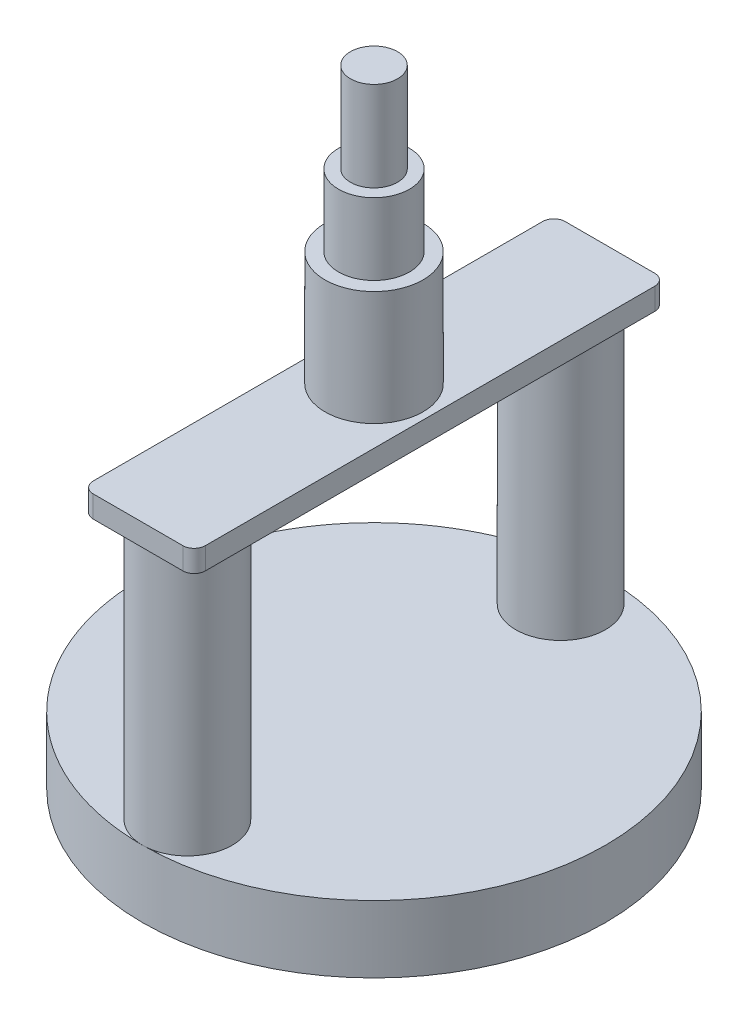
ISO-10303-21;
HEADER;
FILE_DESCRIPTION(('STEP AP214'),'2;1');
FILE_NAME('part.step','',(''),(''),'','','');
FILE_SCHEMA(('AUTOMOTIVE_DESIGN { 1 0 10303 214 1 1 1 1 }'));
ENDSEC;
DATA;
#1=APPLICATION_CONTEXT('core data for automotive mechanical design processes');
#2=APPLICATION_PROTOCOL_DEFINITION('international standard','automotive_design',2000,#1);
#3=PRODUCT_CONTEXT('',#1,'mechanical');
#4=PRODUCT('Part','Part','',(#3));
#5=PRODUCT_RELATED_PRODUCT_CATEGORY('part','',(#4));
#6=PRODUCT_DEFINITION_FORMATION('','',#4);
#7=PRODUCT_DEFINITION_CONTEXT('part definition',#1,'design');
#8=PRODUCT_DEFINITION('design','',#6,#7);
#9=PRODUCT_DEFINITION_SHAPE('','',#8);
#10=(LENGTH_UNIT() NAMED_UNIT(*) SI_UNIT(.MILLI.,.METRE.));
#11=(NAMED_UNIT(*) PLANE_ANGLE_UNIT() SI_UNIT($,.RADIAN.));
#12=(NAMED_UNIT(*) SI_UNIT($,.STERADIAN.) SOLID_ANGLE_UNIT());
#13=UNCERTAINTY_MEASURE_WITH_UNIT(LENGTH_MEASURE(1.E-05),#10,'distance_accuracy_value','');
#14=(GEOMETRIC_REPRESENTATION_CONTEXT(3) GLOBAL_UNCERTAINTY_ASSIGNED_CONTEXT((#13)) GLOBAL_UNIT_ASSIGNED_CONTEXT((#10,
#11,#12)) REPRESENTATION_CONTEXT('',''));
#15=CARTESIAN_POINT('',(0.,0.,0.));
#16=DIRECTION('',(0.,0.,1.));
#17=DIRECTION('',(1.,0.,0.));
#18=AXIS2_PLACEMENT_3D('',#15,#16,#17);
#19=CARTESIAN_POINT('',(0.,5.98,0.));
#20=DIRECTION('',(0.,-1.,0.));
#21=DIRECTION('',(0.,0.,-1.));
#22=AXIS2_PLACEMENT_3D('',#19,#20,#21);
#23=CYLINDRICAL_SURFACE('',#22,20.65);
#24=CARTESIAN_POINT('',(0.,5.98,0.));
#25=DIRECTION('',(0.,1.,0.));
#26=DIRECTION('',(0.,0.,1.));
#27=AXIS2_PLACEMENT_3D('',#24,#25,#26);
#28=CIRCLE('',#27,20.65);
#29=CARTESIAN_POINT('',(0.,5.98,20.65));
#30=VERTEX_POINT('',#29);
#31=CARTESIAN_POINT('',(0.,5.98,-20.65));
#32=VERTEX_POINT('',#31);
#33=EDGE_CURVE('E146',#30,#32,#28,.T.);
#34=ORIENTED_EDGE('',*,*,#33,.F.);
#35=EDGE_CURVE('E53',#32,#30,#28,.T.);
#36=ORIENTED_EDGE('',*,*,#35,.F.);
#37=EDGE_LOOP('',(#34,#36));
#38=FACE_BOUND('',#37,.T.);
#39=CARTESIAN_POINT('',(0.,0.,0.));
#40=DIRECTION('',(0.,1.,0.));
#41=DIRECTION('',(0.,0.,1.));
#42=AXIS2_PLACEMENT_3D('',#39,#40,#41);
#43=CIRCLE('',#42,20.65);
#44=CARTESIAN_POINT('',(0.,0.,20.65));
#45=VERTEX_POINT('',#44);
#46=EDGE_CURVE('E143',#45,#45,#43,.T.);
#47=ORIENTED_EDGE('',*,*,#46,.T.);
#48=EDGE_LOOP('',(#47));
#49=FACE_BOUND('',#48,.T.);
#50=ADVANCED_FACE('F33',(#38,#49),#23,.T.);
#51=CARTESIAN_POINT('',(0.,5.98,0.));
#52=DIRECTION('',(0.,1.,0.));
#53=DIRECTION('',(0.,0.,1.));
#54=AXIS2_PLACEMENT_3D('',#51,#52,#53);
#55=PLANE('',#54);
#56=ORIENTED_EDGE('',*,*,#33,.T.);
#57=CARTESIAN_POINT('',(0.,5.98,-16.65));
#58=DIRECTION('',(0.,1.,0.));
#59=DIRECTION('',(0.,0.,1.));
#60=AXIS2_PLACEMENT_3D('',#57,#58,#59);
#61=CIRCLE('',#60,4.);
#62=EDGE_CURVE('E47',#32,#32,#61,.T.);
#63=ORIENTED_EDGE('',*,*,#62,.F.);
#64=ORIENTED_EDGE('',*,*,#35,.T.);
#65=CARTESIAN_POINT('',(0.,5.98,16.65));
#66=DIRECTION('',(0.,1.,0.));
#67=DIRECTION('',(0.,0.,1.));
#68=AXIS2_PLACEMENT_3D('',#65,#66,#67);
#69=CIRCLE('',#68,4.);
#70=EDGE_CURVE('E138',#30,#30,#69,.T.);
#71=ORIENTED_EDGE('',*,*,#70,.F.);
#72=EDGE_LOOP('',(#56,#63,#64,#71));
#73=FACE_BOUND('',#72,.T.);
#74=ADVANCED_FACE('F155',(#73),#55,.T.);
#75=CARTESIAN_POINT('',(0.,0.,0.));
#76=DIRECTION('',(0.,1.,0.));
#77=DIRECTION('',(0.,0.,1.));
#78=AXIS2_PLACEMENT_3D('',#75,#76,#77);
#79=PLANE('',#78);
#80=ORIENTED_EDGE('',*,*,#46,.F.);
#81=EDGE_LOOP('',(#80));
#82=FACE_BOUND('',#81,.T.);
#83=ADVANCED_FACE('F152',(#82),#79,.F.);
#84=CARTESIAN_POINT('',(0.,29.38,16.65));
#85=DIRECTION('',(0.,-1.,0.));
#86=DIRECTION('',(0.,0.,-1.));
#87=AXIS2_PLACEMENT_3D('',#84,#85,#86);
#88=CYLINDRICAL_SURFACE('',#87,4.);
#89=CARTESIAN_POINT('',(0.,29.38,16.65));
#90=DIRECTION('',(0.,1.,0.));
#91=DIRECTION('',(0.,0.,1.));
#92=AXIS2_PLACEMENT_3D('',#89,#90,#91);
#93=CIRCLE('',#92,4.);
#94=CARTESIAN_POINT('',(0.,29.38,20.65));
#95=VERTEX_POINT('',#94);
#96=EDGE_CURVE('E140',#95,#95,#93,.T.);
#97=ORIENTED_EDGE('',*,*,#96,.F.);
#98=EDGE_LOOP('',(#97));
#99=FACE_BOUND('',#98,.T.);
#100=ORIENTED_EDGE('',*,*,#70,.T.);
#101=EDGE_LOOP('',(#100));
#102=FACE_BOUND('',#101,.T.);
#103=ADVANCED_FACE('F154',(#99,#102),#88,.T.);
#104=CARTESIAN_POINT('',(0.,29.38,-16.65));
#105=DIRECTION('',(0.,-1.,0.));
#106=DIRECTION('',(0.,0.,-1.));
#107=AXIS2_PLACEMENT_3D('',#104,#105,#106);
#108=CYLINDRICAL_SURFACE('',#107,4.);
#109=CARTESIAN_POINT('',(0.,29.38,-16.65));
#110=DIRECTION('',(0.,1.,0.));
#111=DIRECTION('',(0.,0.,1.));
#112=AXIS2_PLACEMENT_3D('',#109,#110,#111);
#113=CIRCLE('',#112,4.);
#114=CARTESIAN_POINT('',(0.,29.38,-12.65));
#115=VERTEX_POINT('',#114);
#116=EDGE_CURVE('E131',#115,#115,#113,.T.);
#117=ORIENTED_EDGE('',*,*,#116,.F.);
#118=EDGE_LOOP('',(#117));
#119=FACE_BOUND('',#118,.T.);
#120=ORIENTED_EDGE('',*,*,#62,.T.);
#121=EDGE_LOOP('',(#120));
#122=FACE_BOUND('',#121,.T.);
#123=ADVANCED_FACE('F160',(#119,#122),#108,.T.);
#124=CARTESIAN_POINT('',(4.,31.33,-20.05));
#125=DIRECTION('',(0.,-1.,0.));
#126=DIRECTION('',(0.,0.,-1.));
#127=AXIS2_PLACEMENT_3D('',#124,#125,#126);
#128=CYLINDRICAL_SURFACE('',#127,1.);
#129=CARTESIAN_POINT('',(4.,29.38,-20.05));
#130=DIRECTION('',(0.,1.,0.));
#131=DIRECTION('',(0.,0.,-1.));
#132=AXIS2_PLACEMENT_3D('',#129,#130,#131);
#133=CIRCLE('',#132,1.);
#134=CARTESIAN_POINT('',(5.,29.38,-20.05));
#135=VERTEX_POINT('',#134);
#136=CARTESIAN_POINT('',(3.99999999999999,29.38,-21.05));
#137=VERTEX_POINT('',#136);
#138=EDGE_CURVE('E129',#135,#137,#133,.T.);
#139=ORIENTED_EDGE('',*,*,#138,.T.);
#140=DIRECTION('',(0.,-1.,0.));
#141=VECTOR('',#140,1.);
#142=CARTESIAN_POINT('',(3.99999999999999,31.33,-21.05));
#143=LINE('',#142,#141);
#144=CARTESIAN_POINT('',(3.99999999999999,31.33,-21.05));
#145=VERTEX_POINT('',#144);
#146=EDGE_CURVE('E109',#145,#137,#143,.T.);
#147=ORIENTED_EDGE('',*,*,#146,.F.);
#148=CARTESIAN_POINT('',(4.,31.33,-20.05));
#149=DIRECTION('',(0.,1.,0.));
#150=DIRECTION('',(0.,0.,-1.));
#151=AXIS2_PLACEMENT_3D('',#148,#149,#150);
#152=CIRCLE('',#151,1.);
#153=CARTESIAN_POINT('',(5.,31.33,-20.05));
#154=VERTEX_POINT('',#153);
#155=EDGE_CURVE('E116',#154,#145,#152,.T.);
#156=ORIENTED_EDGE('',*,*,#155,.F.);
#157=DIRECTION('',(0.,-1.,0.));
#158=VECTOR('',#157,1.);
#159=CARTESIAN_POINT('',(5.,31.33,-20.05));
#160=LINE('',#159,#158);
#161=EDGE_CURVE('E370',#154,#135,#160,.T.);
#162=ORIENTED_EDGE('',*,*,#161,.T.);
#163=EDGE_LOOP('',(#139,#147,#156,#162));
#164=FACE_BOUND('',#163,.T.);
#165=ADVANCED_FACE('F127',(#164),#128,.T.);
#166=CARTESIAN_POINT('',(-3.99999999999999,31.33,-21.05));
#167=DIRECTION('',(0.,0.,1.));
#168=DIRECTION('',(1.,0.,0.));
#169=AXIS2_PLACEMENT_3D('',#166,#167,#168);
#170=PLANE('',#169);
#171=DIRECTION('',(-1.,0.,0.));
#172=VECTOR('',#171,1.);
#173=CARTESIAN_POINT('',(-3.99999999999999,29.38,-21.05));
#174=LINE('',#173,#172);
#175=CARTESIAN_POINT('',(-3.99999999999999,29.38,-21.05));
#176=VERTEX_POINT('',#175);
#177=EDGE_CURVE('E372',#137,#176,#174,.T.);
#178=ORIENTED_EDGE('',*,*,#177,.T.);
#179=DIRECTION('',(0.,-1.,0.));
#180=VECTOR('',#179,1.);
#181=CARTESIAN_POINT('',(-3.99999999999999,31.33,-21.05));
#182=LINE('',#181,#180);
#183=CARTESIAN_POINT('',(-3.99999999999999,31.33,-21.05));
#184=VERTEX_POINT('',#183);
#185=EDGE_CURVE('E112',#184,#176,#182,.T.);
#186=ORIENTED_EDGE('',*,*,#185,.F.);
#187=DIRECTION('',(-1.,0.,0.));
#188=VECTOR('',#187,1.);
#189=CARTESIAN_POINT('',(-3.99999999999999,31.33,-21.05));
#190=LINE('',#189,#188);
#191=EDGE_CURVE('E105',#145,#184,#190,.T.);
#192=ORIENTED_EDGE('',*,*,#191,.F.);
#193=ORIENTED_EDGE('',*,*,#146,.T.);
#194=EDGE_LOOP('',(#178,#186,#192,#193));
#195=FACE_BOUND('',#194,.T.);
#196=ADVANCED_FACE('F107',(#195),#170,.F.);
#197=CARTESIAN_POINT('',(-4.,31.33,-20.05));
#198=DIRECTION('',(0.,-1.,0.));
#199=DIRECTION('',(0.,0.,-1.));
#200=AXIS2_PLACEMENT_3D('',#197,#198,#199);
#201=CYLINDRICAL_SURFACE('',#200,1.);
#202=CARTESIAN_POINT('',(-4.,29.38,-20.05));
#203=DIRECTION('',(0.,1.,0.));
#204=DIRECTION('',(0.,0.,-1.));
#205=AXIS2_PLACEMENT_3D('',#202,#203,#204);
#206=CIRCLE('',#205,1.);
#207=CARTESIAN_POINT('',(-5.,29.38,-20.05));
#208=VERTEX_POINT('',#207);
#209=EDGE_CURVE('E374',#176,#208,#206,.T.);
#210=ORIENTED_EDGE('',*,*,#209,.T.);
#211=DIRECTION('',(0.,-1.,0.));
#212=VECTOR('',#211,1.);
#213=CARTESIAN_POINT('',(-5.,31.33,-20.05));
#214=LINE('',#213,#212);
#215=CARTESIAN_POINT('',(-5.,31.33,-20.05));
#216=VERTEX_POINT('',#215);
#217=EDGE_CURVE('E133',#216,#208,#214,.T.);
#218=ORIENTED_EDGE('',*,*,#217,.F.);
#219=CARTESIAN_POINT('',(-4.,31.33,-20.05));
#220=DIRECTION('',(0.,1.,0.));
#221=DIRECTION('',(0.,0.,-1.));
#222=AXIS2_PLACEMENT_3D('',#219,#220,#221);
#223=CIRCLE('',#222,1.);
#224=EDGE_CURVE('E115',#184,#216,#223,.T.);
#225=ORIENTED_EDGE('',*,*,#224,.F.);
#226=ORIENTED_EDGE('',*,*,#185,.T.);
#227=EDGE_LOOP('',(#210,#218,#225,#226));
#228=FACE_BOUND('',#227,.T.);
#229=ADVANCED_FACE('F205',(#228),#201,.T.);
#230=CARTESIAN_POINT('',(-5.,31.33,20.05));
#231=DIRECTION('',(1.,0.,0.));
#232=DIRECTION('',(0.,0.,-1.));
#233=AXIS2_PLACEMENT_3D('',#230,#231,#232);
#234=PLANE('',#233);
#235=DIRECTION('',(0.,0.,1.));
#236=VECTOR('',#235,1.);
#237=CARTESIAN_POINT('',(-5.,29.38,20.05));
#238=LINE('',#237,#236);
#239=CARTESIAN_POINT('',(-5.,29.38,20.05));
#240=VERTEX_POINT('',#239);
#241=EDGE_CURVE('E376',#208,#240,#238,.T.);
#242=ORIENTED_EDGE('',*,*,#241,.T.);
#243=DIRECTION('',(0.,-1.,0.));
#244=VECTOR('',#243,1.);
#245=CARTESIAN_POINT('',(-5.,31.33,20.05));
#246=LINE('',#245,#244);
#247=CARTESIAN_POINT('',(-5.,31.33,20.05));
#248=VERTEX_POINT('',#247);
#249=EDGE_CURVE('E395',#248,#240,#246,.T.);
#250=ORIENTED_EDGE('',*,*,#249,.F.);
#251=DIRECTION('',(0.,0.,1.));
#252=VECTOR('',#251,1.);
#253=CARTESIAN_POINT('',(-5.,31.33,20.05));
#254=LINE('',#253,#252);
#255=EDGE_CURVE('E361',#216,#248,#254,.T.);
#256=ORIENTED_EDGE('',*,*,#255,.F.);
#257=ORIENTED_EDGE('',*,*,#217,.T.);
#258=EDGE_LOOP('',(#242,#250,#256,#257));
#259=FACE_BOUND('',#258,.T.);
#260=ADVANCED_FACE('F214',(#259),#234,.F.);
#261=CARTESIAN_POINT('',(-4.,31.33,20.05));
#262=DIRECTION('',(0.,-1.,0.));
#263=DIRECTION('',(0.,0.,-1.));
#264=AXIS2_PLACEMENT_3D('',#261,#262,#263);
#265=CYLINDRICAL_SURFACE('',#264,1.);
#266=CARTESIAN_POINT('',(-4.,29.38,20.05));
#267=DIRECTION('',(0.,1.,0.));
#268=DIRECTION('',(0.,0.,-1.));
#269=AXIS2_PLACEMENT_3D('',#266,#267,#268);
#270=CIRCLE('',#269,1.);
#271=CARTESIAN_POINT('',(-3.99999999999999,29.38,21.05));
#272=VERTEX_POINT('',#271);
#273=EDGE_CURVE('E378',#240,#272,#270,.T.);
#274=ORIENTED_EDGE('',*,*,#273,.T.);
#275=DIRECTION('',(0.,-1.,0.));
#276=VECTOR('',#275,1.);
#277=CARTESIAN_POINT('',(-3.99999999999999,31.33,21.05));
#278=LINE('',#277,#276);
#279=CARTESIAN_POINT('',(-3.99999999999999,31.33,21.05));
#280=VERTEX_POINT('',#279);
#281=EDGE_CURVE('E392',#280,#272,#278,.T.);
#282=ORIENTED_EDGE('',*,*,#281,.F.);
#283=CARTESIAN_POINT('',(-4.,31.33,20.05));
#284=DIRECTION('',(0.,1.,0.));
#285=DIRECTION('',(0.,0.,-1.));
#286=AXIS2_PLACEMENT_3D('',#283,#284,#285);
#287=CIRCLE('',#286,1.);
#288=EDGE_CURVE('E363',#248,#280,#287,.T.);
#289=ORIENTED_EDGE('',*,*,#288,.F.);
#290=ORIENTED_EDGE('',*,*,#249,.T.);
#291=EDGE_LOOP('',(#274,#282,#289,#290));
#292=FACE_BOUND('',#291,.T.);
#293=ADVANCED_FACE('F224',(#292),#265,.T.);
#294=CARTESIAN_POINT('',(-3.99999999999999,31.33,21.05));
#295=DIRECTION('',(0.,0.,-1.));
#296=DIRECTION('',(-1.,0.,0.));
#297=AXIS2_PLACEMENT_3D('',#294,#295,#296);
#298=PLANE('',#297);
#299=DIRECTION('',(1.,0.,0.));
#300=VECTOR('',#299,1.);
#301=CARTESIAN_POINT('',(-3.99999999999999,29.38,21.05));
#302=LINE('',#301,#300);
#303=CARTESIAN_POINT('',(3.99999999999999,29.38,21.05));
#304=VERTEX_POINT('',#303);
#305=EDGE_CURVE('E380',#272,#304,#302,.T.);
#306=ORIENTED_EDGE('',*,*,#305,.T.);
#307=DIRECTION('',(0.,-1.,0.));
#308=VECTOR('',#307,1.);
#309=CARTESIAN_POINT('',(3.99999999999999,31.33,21.05));
#310=LINE('',#309,#308);
#311=CARTESIAN_POINT('',(3.99999999999999,31.33,21.05));
#312=VERTEX_POINT('',#311);
#313=EDGE_CURVE('E389',#312,#304,#310,.T.);
#314=ORIENTED_EDGE('',*,*,#313,.F.);
#315=DIRECTION('',(1.,0.,0.));
#316=VECTOR('',#315,1.);
#317=CARTESIAN_POINT('',(-3.99999999999999,31.33,21.05));
#318=LINE('',#317,#316);
#319=EDGE_CURVE('E365',#280,#312,#318,.T.);
#320=ORIENTED_EDGE('',*,*,#319,.F.);
#321=ORIENTED_EDGE('',*,*,#281,.T.);
#322=EDGE_LOOP('',(#306,#314,#320,#321));
#323=FACE_BOUND('',#322,.T.);
#324=ADVANCED_FACE('F234',(#323),#298,.F.);
#325=CARTESIAN_POINT('',(4.,31.33,20.05));
#326=DIRECTION('',(0.,-1.,0.));
#327=DIRECTION('',(0.,0.,-1.));
#328=AXIS2_PLACEMENT_3D('',#325,#326,#327);
#329=CYLINDRICAL_SURFACE('',#328,1.);
#330=CARTESIAN_POINT('',(4.,29.38,20.05));
#331=DIRECTION('',(0.,1.,0.));
#332=DIRECTION('',(0.,0.,1.));
#333=AXIS2_PLACEMENT_3D('',#330,#331,#332);
#334=CIRCLE('',#333,1.);
#335=CARTESIAN_POINT('',(5.,29.38,20.05));
#336=VERTEX_POINT('',#335);
#337=EDGE_CURVE('E382',#304,#336,#334,.T.);
#338=ORIENTED_EDGE('',*,*,#337,.T.);
#339=DIRECTION('',(0.,-1.,0.));
#340=VECTOR('',#339,1.);
#341=CARTESIAN_POINT('',(5.,31.33,20.05));
#342=LINE('',#341,#340);
#343=CARTESIAN_POINT('',(5.,31.33,20.05));
#344=VERTEX_POINT('',#343);
#345=EDGE_CURVE('E386',#344,#336,#342,.T.);
#346=ORIENTED_EDGE('',*,*,#345,.F.);
#347=CARTESIAN_POINT('',(4.,31.33,20.05));
#348=DIRECTION('',(0.,1.,0.));
#349=DIRECTION('',(0.,0.,1.));
#350=AXIS2_PLACEMENT_3D('',#347,#348,#349);
#351=CIRCLE('',#350,1.);
#352=EDGE_CURVE('E367',#312,#344,#351,.T.);
#353=ORIENTED_EDGE('',*,*,#352,.F.);
#354=ORIENTED_EDGE('',*,*,#313,.T.);
#355=EDGE_LOOP('',(#338,#346,#353,#354));
#356=FACE_BOUND('',#355,.T.);
#357=ADVANCED_FACE('F244',(#356),#329,.T.);
#358=CARTESIAN_POINT('',(5.,31.33,20.05));
#359=DIRECTION('',(-1.,0.,0.));
#360=DIRECTION('',(0.,0.,1.));
#361=AXIS2_PLACEMENT_3D('',#358,#359,#360);
#362=PLANE('',#361);
#363=DIRECTION('',(0.,0.,-1.));
#364=VECTOR('',#363,1.);
#365=CARTESIAN_POINT('',(5.,29.38,20.05));
#366=LINE('',#365,#364);
#367=EDGE_CURVE('E125',#336,#135,#366,.T.);
#368=ORIENTED_EDGE('',*,*,#367,.T.);
#369=ORIENTED_EDGE('',*,*,#161,.F.);
#370=DIRECTION('',(0.,0.,-1.));
#371=VECTOR('',#370,1.);
#372=CARTESIAN_POINT('',(5.,31.33,20.05));
#373=LINE('',#372,#371);
#374=EDGE_CURVE('E121',#344,#154,#373,.T.);
#375=ORIENTED_EDGE('',*,*,#374,.F.);
#376=ORIENTED_EDGE('',*,*,#345,.T.);
#377=EDGE_LOOP('',(#368,#369,#375,#376));
#378=FACE_BOUND('',#377,.T.);
#379=ADVANCED_FACE('F254',(#378),#362,.F.);
#380=CARTESIAN_POINT('',(4.,31.33,-20.05));
#381=DIRECTION('',(0.,-1.,0.));
#382=DIRECTION('',(0.,0.,-1.));
#383=AXIS2_PLACEMENT_3D('',#380,#381,#382);
#384=PLANE('',#383);
#385=CARTESIAN_POINT('',(0.,31.33,0.));
#386=DIRECTION('',(0.,-1.,0.));
#387=DIRECTION('',(0.,0.,-1.));
#388=AXIS2_PLACEMENT_3D('',#385,#386,#387);
#389=CIRCLE('',#388,4.375);
#390=CARTESIAN_POINT('',(0.,31.33,-4.375));
#391=VERTEX_POINT('',#390);
#392=EDGE_CURVE('E36',#391,#391,#389,.F.);
#393=ORIENTED_EDGE('',*,*,#392,.F.);
#394=EDGE_LOOP('',(#393));
#395=FACE_BOUND('',#394,.T.);
#396=ORIENTED_EDGE('',*,*,#155,.T.);
#397=ORIENTED_EDGE('',*,*,#191,.T.);
#398=ORIENTED_EDGE('',*,*,#224,.T.);
#399=ORIENTED_EDGE('',*,*,#255,.T.);
#400=ORIENTED_EDGE('',*,*,#288,.T.);
#401=ORIENTED_EDGE('',*,*,#319,.T.);
#402=ORIENTED_EDGE('',*,*,#352,.T.);
#403=ORIENTED_EDGE('',*,*,#374,.T.);
#404=EDGE_LOOP('',(#396,#397,#398,#399,#400,#401,#402,#403));
#405=FACE_BOUND('',#404,.T.);
#406=ADVANCED_FACE('F119',(#395,#405),#384,.F.);
#407=CARTESIAN_POINT('',(4.,29.38,-20.05));
#408=DIRECTION('',(0.,-1.,0.));
#409=DIRECTION('',(0.,0.,-1.));
#410=AXIS2_PLACEMENT_3D('',#407,#408,#409);
#411=PLANE('',#410);
#412=ORIENTED_EDGE('',*,*,#96,.T.);
#413=EDGE_LOOP('',(#412));
#414=FACE_BOUND('',#413,.T.);
#415=ORIENTED_EDGE('',*,*,#116,.T.);
#416=EDGE_LOOP('',(#415));
#417=FACE_BOUND('',#416,.T.);
#418=ORIENTED_EDGE('',*,*,#138,.F.);
#419=ORIENTED_EDGE('',*,*,#367,.F.);
#420=ORIENTED_EDGE('',*,*,#337,.F.);
#421=ORIENTED_EDGE('',*,*,#305,.F.);
#422=ORIENTED_EDGE('',*,*,#273,.F.);
#423=ORIENTED_EDGE('',*,*,#241,.F.);
#424=ORIENTED_EDGE('',*,*,#209,.F.);
#425=ORIENTED_EDGE('',*,*,#177,.F.);
#426=EDGE_LOOP('',(#418,#419,#420,#421,#422,#423,#424,#425));
#427=FACE_BOUND('',#426,.T.);
#428=ADVANCED_FACE('F271',(#414,#417,#427),#411,.T.);
#429=CARTESIAN_POINT('',(0.,41.53,0.));
#430=DIRECTION('',(0.,-1.,0.));
#431=DIRECTION('',(0.,0.,-1.));
#432=AXIS2_PLACEMENT_3D('',#429,#430,#431);
#433=CYLINDRICAL_SURFACE('',#432,4.375);
#434=CARTESIAN_POINT('',(0.,41.53,0.));
#435=DIRECTION('',(0.,1.,0.));
#436=DIRECTION('',(0.,0.,1.));
#437=AXIS2_PLACEMENT_3D('',#434,#435,#436);
#438=CIRCLE('',#437,4.375);
#439=CARTESIAN_POINT('',(0.,41.53,4.375));
#440=VERTEX_POINT('',#439);
#441=EDGE_CURVE('E353',#440,#440,#438,.T.);
#442=ORIENTED_EDGE('',*,*,#441,.F.);
#443=EDGE_LOOP('',(#442));
#444=FACE_BOUND('',#443,.T.);
#445=ORIENTED_EDGE('',*,*,#392,.T.);
#446=EDGE_LOOP('',(#445));
#447=FACE_BOUND('',#446,.T.);
#448=ADVANCED_FACE('F276',(#444,#447),#433,.T.);
#449=CARTESIAN_POINT('',(0.,41.53,0.));
#450=DIRECTION('',(0.,1.,0.));
#451=DIRECTION('',(0.,0.,1.));
#452=AXIS2_PLACEMENT_3D('',#449,#450,#451);
#453=PLANE('',#452);
#454=CARTESIAN_POINT('',(0.,41.53,0.));
#455=DIRECTION('',(0.,1.,0.));
#456=DIRECTION('',(0.,0.,1.));
#457=AXIS2_PLACEMENT_3D('',#454,#455,#456);
#458=CIRCLE('',#457,3.165);
#459=CARTESIAN_POINT('',(0.,41.53,3.165));
#460=VERTEX_POINT('',#459);
#461=EDGE_CURVE('E41',#460,#460,#458,.T.);
#462=ORIENTED_EDGE('',*,*,#461,.F.);
#463=EDGE_LOOP('',(#462));
#464=FACE_BOUND('',#463,.T.);
#465=ORIENTED_EDGE('',*,*,#441,.T.);
#466=EDGE_LOOP('',(#465));
#467=FACE_BOUND('',#466,.T.);
#468=ADVANCED_FACE('F293',(#464,#467),#453,.T.);
#469=CARTESIAN_POINT('',(0.,47.93,0.));
#470=DIRECTION('',(0.,-1.,0.));
#471=DIRECTION('',(0.,0.,-1.));
#472=AXIS2_PLACEMENT_3D('',#469,#470,#471);
#473=CYLINDRICAL_SURFACE('',#472,3.165);
#474=CARTESIAN_POINT('',(0.,47.93,0.));
#475=DIRECTION('',(0.,1.,0.));
#476=DIRECTION('',(0.,0.,1.));
#477=AXIS2_PLACEMENT_3D('',#474,#475,#476);
#478=CIRCLE('',#477,3.165);
#479=CARTESIAN_POINT('',(0.,47.93,3.165));
#480=VERTEX_POINT('',#479);
#481=EDGE_CURVE('E350',#480,#480,#478,.T.);
#482=ORIENTED_EDGE('',*,*,#481,.F.);
#483=EDGE_LOOP('',(#482));
#484=FACE_BOUND('',#483,.T.);
#485=ORIENTED_EDGE('',*,*,#461,.T.);
#486=EDGE_LOOP('',(#485));
#487=FACE_BOUND('',#486,.T.);
#488=ADVANCED_FACE('F303',(#484,#487),#473,.T.);
#489=CARTESIAN_POINT('',(0.,47.93,0.));
#490=DIRECTION('',(0.,1.,0.));
#491=DIRECTION('',(0.,0.,1.));
#492=AXIS2_PLACEMENT_3D('',#489,#490,#491);
#493=PLANE('',#492);
#494=CARTESIAN_POINT('',(0.,47.93,0.));
#495=DIRECTION('',(0.,1.,0.));
#496=DIRECTION('',(0.,0.,1.));
#497=AXIS2_PLACEMENT_3D('',#494,#495,#496);
#498=CIRCLE('',#497,2.1);
#499=CARTESIAN_POINT('',(0.,47.93,2.1));
#500=VERTEX_POINT('',#499);
#501=EDGE_CURVE('E11',#500,#500,#498,.T.);
#502=ORIENTED_EDGE('',*,*,#501,.F.);
#503=EDGE_LOOP('',(#502));
#504=FACE_BOUND('',#503,.T.);
#505=ORIENTED_EDGE('',*,*,#481,.T.);
#506=EDGE_LOOP('',(#505));
#507=FACE_BOUND('',#506,.T.);
#508=ADVANCED_FACE('F313',(#504,#507),#493,.T.);
#509=CARTESIAN_POINT('',(0.,55.93,0.));
#510=DIRECTION('',(0.,-1.,0.));
#511=DIRECTION('',(0.,0.,-1.));
#512=AXIS2_PLACEMENT_3D('',#509,#510,#511);
#513=CYLINDRICAL_SURFACE('',#512,2.1);
#514=CARTESIAN_POINT('',(0.,55.93,0.));
#515=DIRECTION('',(0.,1.,0.));
#516=DIRECTION('',(0.,0.,1.));
#517=AXIS2_PLACEMENT_3D('',#514,#515,#516);
#518=CIRCLE('',#517,2.1);
#519=CARTESIAN_POINT('',(0.,55.93,2.1));
#520=VERTEX_POINT('',#519);
#521=EDGE_CURVE('E349',#520,#520,#518,.T.);
#522=ORIENTED_EDGE('',*,*,#521,.F.);
#523=EDGE_LOOP('',(#522));
#524=FACE_BOUND('',#523,.T.);
#525=ORIENTED_EDGE('',*,*,#501,.T.);
#526=EDGE_LOOP('',(#525));
#527=FACE_BOUND('',#526,.T.);
#528=ADVANCED_FACE('F323',(#524,#527),#513,.T.);
#529=CARTESIAN_POINT('',(0.,55.93,0.));
#530=DIRECTION('',(0.,1.,0.));
#531=DIRECTION('',(0.,0.,1.));
#532=AXIS2_PLACEMENT_3D('',#529,#530,#531);
#533=PLANE('',#532);
#534=ORIENTED_EDGE('',*,*,#521,.T.);
#535=EDGE_LOOP('',(#534));
#536=FACE_BOUND('',#535,.T.);
#537=ADVANCED_FACE('F333',(#536),#533,.T.);
#538=CLOSED_SHELL('',(#50,#74,#83,#103,#123,#165,#196,#229,#260,#293,#324,#357,#379,#406,#428,
#448,#468,#488,#508,#528,#537));
#539=MANIFOLD_SOLID_BREP('B2',#538);
#540=ADVANCED_BREP_SHAPE_REPRESENTATION('',(#18,#539),#14);
#541=SHAPE_DEFINITION_REPRESENTATION(#9,#540);
ENDSEC;
END-ISO-10303-21;
